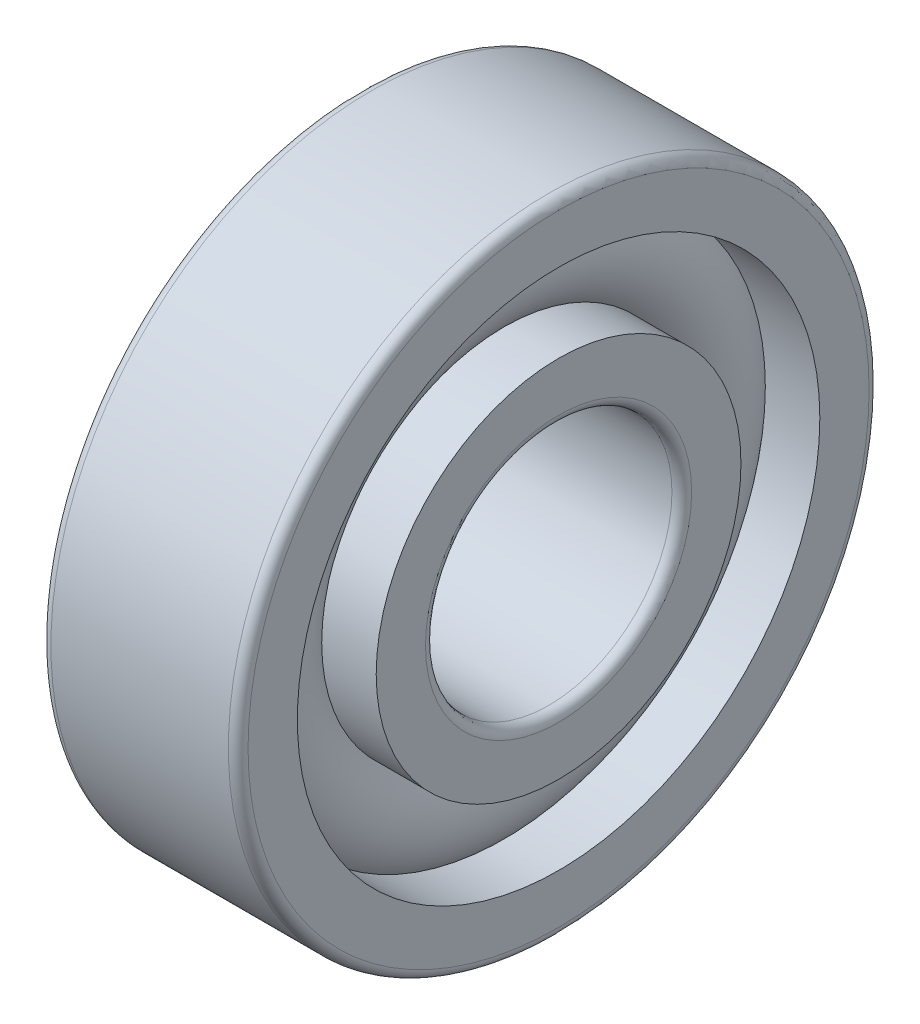
ISO-10303-21;
HEADER;
FILE_DESCRIPTION(('STEP AP214'),'2;1');
FILE_NAME('part.step','',(''),(''),'','','');
FILE_SCHEMA(('AUTOMOTIVE_DESIGN { 1 0 10303 214 1 1 1 1 }'));
ENDSEC;
DATA;
#1=APPLICATION_CONTEXT('core data for automotive mechanical design processes');
#2=APPLICATION_PROTOCOL_DEFINITION('international standard','automotive_design',2000,#1);
#3=PRODUCT_CONTEXT('',#1,'mechanical');
#4=PRODUCT('Part','Part','',(#3));
#5=PRODUCT_RELATED_PRODUCT_CATEGORY('part','',(#4));
#6=PRODUCT_DEFINITION_FORMATION('','',#4);
#7=PRODUCT_DEFINITION_CONTEXT('part definition',#1,'design');
#8=PRODUCT_DEFINITION('design','',#6,#7);
#9=PRODUCT_DEFINITION_SHAPE('','',#8);
#10=(LENGTH_UNIT() NAMED_UNIT(*) SI_UNIT(.MILLI.,.METRE.));
#11=(NAMED_UNIT(*) PLANE_ANGLE_UNIT() SI_UNIT($,.RADIAN.));
#12=(NAMED_UNIT(*) SI_UNIT($,.STERADIAN.) SOLID_ANGLE_UNIT());
#13=UNCERTAINTY_MEASURE_WITH_UNIT(LENGTH_MEASURE(1.E-05),#10,'distance_accuracy_value','');
#14=(GEOMETRIC_REPRESENTATION_CONTEXT(3) GLOBAL_UNCERTAINTY_ASSIGNED_CONTEXT((#13)) GLOBAL_UNIT_ASSIGNED_CONTEXT((#10,
#11,#12)) REPRESENTATION_CONTEXT('',''));
#15=CARTESIAN_POINT('',(0.,0.,0.));
#16=DIRECTION('',(0.,0.,1.));
#17=DIRECTION('',(1.,0.,0.));
#18=AXIS2_PLACEMENT_3D('',#15,#16,#17);
#19=CARTESIAN_POINT('',(0.,0.,0.));
#20=DIRECTION('',(-1.,0.,0.));
#21=DIRECTION('',(0.,0.,1.));
#22=AXIS2_PLACEMENT_3D('',#19,#20,#21);
#23=TOROIDAL_SURFACE('',#22,4.5,1.2);
#24=CARTESIAN_POINT('',(0.894427190999912,0.,0.));
#25=DIRECTION('',(-1.,0.,0.));
#26=DIRECTION('',(0.,0.,1.));
#27=AXIS2_PLACEMENT_3D('',#24,#25,#26);
#28=CIRCLE('',#27,5.3);
#29=CARTESIAN_POINT('',(0.894427190999912,0.,5.3));
#30=VERTEX_POINT('',#29);
#31=EDGE_CURVE('E34',#30,#30,#28,.F.);
#32=ORIENTED_EDGE('',*,*,#31,.T.);
#33=EDGE_LOOP('',(#32));
#34=FACE_BOUND('',#33,.T.);
#35=CARTESIAN_POINT('',(0.894427190999916,0.,0.));
#36=DIRECTION('',(-1.,0.,0.));
#37=DIRECTION('',(0.,0.,1.));
#38=AXIS2_PLACEMENT_3D('',#35,#36,#37);
#39=CIRCLE('',#38,3.7);
#40=CARTESIAN_POINT('',(0.894427190999916,0.,3.7));
#41=VERTEX_POINT('',#40);
#42=EDGE_CURVE('E10',#41,#41,#39,.T.);
#43=ORIENTED_EDGE('',*,*,#42,.T.);
#44=EDGE_LOOP('',(#43));
#45=FACE_BOUND('',#44,.T.);
#46=ADVANCED_FACE('F30',(#34,#45),#23,.T.);
#47=CARTESIAN_POINT('',(-20.6375,0.,0.));
#48=DIRECTION('',(1.,0.,0.));
#49=DIRECTION('',(0.,0.,-1.));
#50=AXIS2_PLACEMENT_3D('',#47,#48,#49);
#51=CYLINDRICAL_SURFACE('',#50,3.7);
#52=CARTESIAN_POINT('',(2.,0.,0.));
#53=DIRECTION('',(1.,0.,0.));
#54=DIRECTION('',(0.,0.,-1.));
#55=AXIS2_PLACEMENT_3D('',#52,#53,#54);
#56=CIRCLE('',#55,3.7);
#57=CARTESIAN_POINT('',(2.,0.,-3.7));
#58=VERTEX_POINT('',#57);
#59=EDGE_CURVE('E43',#58,#58,#56,.T.);
#60=ORIENTED_EDGE('',*,*,#59,.F.);
#61=EDGE_LOOP('',(#60));
#62=FACE_BOUND('',#61,.T.);
#63=ORIENTED_EDGE('',*,*,#42,.F.);
#64=EDGE_LOOP('',(#63));
#65=FACE_BOUND('',#64,.T.);
#66=ADVANCED_FACE('F82',(#62,#65),#51,.T.);
#67=CARTESIAN_POINT('',(-20.6375,0.,0.));
#68=DIRECTION('',(1.,0.,0.));
#69=DIRECTION('',(0.,0.,-1.));
#70=AXIS2_PLACEMENT_3D('',#67,#68,#69);
#71=CYLINDRICAL_SURFACE('',#70,3.7);
#72=CARTESIAN_POINT('',(-2.,0.,0.));
#73=DIRECTION('',(1.,0.,0.));
#74=DIRECTION('',(0.,0.,-1.));
#75=AXIS2_PLACEMENT_3D('',#72,#73,#74);
#76=CIRCLE('',#75,3.7);
#77=CARTESIAN_POINT('',(-2.,0.,-3.7));
#78=VERTEX_POINT('',#77);
#79=EDGE_CURVE('E52',#78,#78,#76,.T.);
#80=ORIENTED_EDGE('',*,*,#79,.T.);
#81=EDGE_LOOP('',(#80));
#82=FACE_BOUND('',#81,.T.);
#83=CARTESIAN_POINT('',(-0.894427190999916,0.,0.));
#84=DIRECTION('',(1.,0.,0.));
#85=DIRECTION('',(0.,0.,-1.));
#86=AXIS2_PLACEMENT_3D('',#83,#84,#85);
#87=CIRCLE('',#86,3.7);
#88=CARTESIAN_POINT('',(-0.894427190999916,0.,-3.7));
#89=VERTEX_POINT('',#88);
#90=EDGE_CURVE('E38',#89,#89,#87,.T.);
#91=ORIENTED_EDGE('',*,*,#90,.F.);
#92=EDGE_LOOP('',(#91));
#93=FACE_BOUND('',#92,.T.);
#94=ADVANCED_FACE('F85',(#82,#93),#71,.T.);
#95=CARTESIAN_POINT('',(2.,2.7,0.));
#96=DIRECTION('',(1.,0.,0.));
#97=DIRECTION('',(0.,0.,-1.));
#98=AXIS2_PLACEMENT_3D('',#95,#96,#97);
#99=PLANE('',#98);
#100=ORIENTED_EDGE('',*,*,#59,.T.);
#101=EDGE_LOOP('',(#100));
#102=FACE_BOUND('',#101,.T.);
#103=CARTESIAN_POINT('',(2.,0.,0.));
#104=DIRECTION('',(1.,0.,0.));
#105=DIRECTION('',(0.,0.,-1.));
#106=AXIS2_PLACEMENT_3D('',#103,#104,#105);
#107=CIRCLE('',#106,2.7);
#108=CARTESIAN_POINT('',(2.,0.,-2.7));
#109=VERTEX_POINT('',#108);
#110=EDGE_CURVE('E74',#109,#109,#107,.T.);
#111=ORIENTED_EDGE('',*,*,#110,.F.);
#112=EDGE_LOOP('',(#111));
#113=FACE_BOUND('',#112,.T.);
#114=ADVANCED_FACE('F79',(#102,#113),#99,.T.);
#115=CARTESIAN_POINT('',(1.8,0.,0.));
#116=DIRECTION('',(1.,0.,0.));
#117=DIRECTION('',(0.,0.,-1.));
#118=AXIS2_PLACEMENT_3D('',#115,#116,#117);
#119=TOROIDAL_SURFACE('',#118,2.7,0.200000000000001);
#120=ORIENTED_EDGE('',*,*,#110,.T.);
#121=EDGE_LOOP('',(#120));
#122=FACE_BOUND('',#121,.T.);
#123=CARTESIAN_POINT('',(1.8,0.,0.));
#124=DIRECTION('',(1.,0.,0.));
#125=DIRECTION('',(0.,0.,-1.));
#126=AXIS2_PLACEMENT_3D('',#123,#124,#125);
#127=CIRCLE('',#126,2.5);
#128=CARTESIAN_POINT('',(1.8,0.,-2.5));
#129=VERTEX_POINT('',#128);
#130=EDGE_CURVE('E71',#129,#129,#127,.T.);
#131=ORIENTED_EDGE('',*,*,#130,.F.);
#132=EDGE_LOOP('',(#131));
#133=FACE_BOUND('',#132,.T.);
#134=ADVANCED_FACE('F96',(#122,#133),#119,.T.);
#135=CARTESIAN_POINT('',(-20.6375,0.,0.));
#136=DIRECTION('',(1.,0.,0.));
#137=DIRECTION('',(0.,0.,-1.));
#138=AXIS2_PLACEMENT_3D('',#135,#136,#137);
#139=CYLINDRICAL_SURFACE('',#138,2.5);
#140=ORIENTED_EDGE('',*,*,#130,.T.);
#141=EDGE_LOOP('',(#140));
#142=FACE_BOUND('',#141,.T.);
#143=CARTESIAN_POINT('',(-1.8,0.,0.));
#144=DIRECTION('',(1.,0.,0.));
#145=DIRECTION('',(0.,0.,-1.));
#146=AXIS2_PLACEMENT_3D('',#143,#144,#145);
#147=CIRCLE('',#146,2.5);
#148=CARTESIAN_POINT('',(-1.8,0.,-2.5));
#149=VERTEX_POINT('',#148);
#150=EDGE_CURVE('E68',#149,#149,#147,.T.);
#151=ORIENTED_EDGE('',*,*,#150,.F.);
#152=EDGE_LOOP('',(#151));
#153=FACE_BOUND('',#152,.T.);
#154=ADVANCED_FACE('F99',(#142,#153),#139,.F.);
#155=CARTESIAN_POINT('',(-1.8,0.,0.));
#156=DIRECTION('',(1.,0.,0.));
#157=DIRECTION('',(0.,0.,-1.));
#158=AXIS2_PLACEMENT_3D('',#155,#156,#157);
#159=TOROIDAL_SURFACE('',#158,2.7,0.200000000000001);
#160=ORIENTED_EDGE('',*,*,#150,.T.);
#161=EDGE_LOOP('',(#160));
#162=FACE_BOUND('',#161,.T.);
#163=CARTESIAN_POINT('',(-2.,0.,0.));
#164=DIRECTION('',(1.,0.,0.));
#165=DIRECTION('',(0.,0.,-1.));
#166=AXIS2_PLACEMENT_3D('',#163,#164,#165);
#167=CIRCLE('',#166,2.7);
#168=CARTESIAN_POINT('',(-2.,0.,-2.7));
#169=VERTEX_POINT('',#168);
#170=EDGE_CURVE('E65',#169,#169,#167,.T.);
#171=ORIENTED_EDGE('',*,*,#170,.F.);
#172=EDGE_LOOP('',(#171));
#173=FACE_BOUND('',#172,.T.);
#174=ADVANCED_FACE('F103',(#162,#173),#159,.T.);
#175=CARTESIAN_POINT('',(-2.,3.7,0.));
#176=DIRECTION('',(-1.,0.,0.));
#177=DIRECTION('',(0.,0.,1.));
#178=AXIS2_PLACEMENT_3D('',#175,#176,#177);
#179=PLANE('',#178);
#180=ORIENTED_EDGE('',*,*,#170,.T.);
#181=EDGE_LOOP('',(#180));
#182=FACE_BOUND('',#181,.T.);
#183=ORIENTED_EDGE('',*,*,#79,.F.);
#184=EDGE_LOOP('',(#183));
#185=FACE_BOUND('',#184,.T.);
#186=ADVANCED_FACE('F107',(#182,#185),#179,.T.);
#187=CARTESIAN_POINT('',(-0.894427190999912,0.,0.));
#188=DIRECTION('',(1.,0.,0.));
#189=DIRECTION('',(0.,0.,-1.));
#190=AXIS2_PLACEMENT_3D('',#187,#188,#189);
#191=CIRCLE('',#190,5.3);
#192=CARTESIAN_POINT('',(-0.894427190999912,0.,-5.3));
#193=VERTEX_POINT('',#192);
#194=EDGE_CURVE('E46',#193,#193,#191,.F.);
#195=ORIENTED_EDGE('',*,*,#194,.T.);
#196=EDGE_LOOP('',(#195));
#197=FACE_BOUND('',#196,.T.);
#198=ORIENTED_EDGE('',*,*,#90,.T.);
#199=EDGE_LOOP('',(#198));
#200=FACE_BOUND('',#199,.T.);
#201=ADVANCED_FACE('F32',(#197,#200),#23,.T.);
#202=CARTESIAN_POINT('',(-20.6375,0.,0.));
#203=DIRECTION('',(1.,0.,0.));
#204=DIRECTION('',(0.,0.,-1.));
#205=AXIS2_PLACEMENT_3D('',#202,#203,#204);
#206=CYLINDRICAL_SURFACE('',#205,5.3);
#207=CARTESIAN_POINT('',(2.,0.,0.));
#208=DIRECTION('',(1.,0.,0.));
#209=DIRECTION('',(0.,0.,-1.));
#210=AXIS2_PLACEMENT_3D('',#207,#208,#209);
#211=CIRCLE('',#210,5.30000000000001);
#212=CARTESIAN_POINT('',(2.,0.,-5.30000000000001));
#213=VERTEX_POINT('',#212);
#214=EDGE_CURVE('E48',#213,#213,#211,.T.);
#215=ORIENTED_EDGE('',*,*,#214,.T.);
#216=EDGE_LOOP('',(#215));
#217=FACE_BOUND('',#216,.T.);
#218=ORIENTED_EDGE('',*,*,#31,.F.);
#219=EDGE_LOOP('',(#218));
#220=FACE_BOUND('',#219,.T.);
#221=ADVANCED_FACE('F112',(#217,#220),#206,.F.);
#222=CARTESIAN_POINT('',(-20.6375,0.,0.));
#223=DIRECTION('',(1.,0.,0.));
#224=DIRECTION('',(0.,0.,-1.));
#225=AXIS2_PLACEMENT_3D('',#222,#223,#224);
#226=CYLINDRICAL_SURFACE('',#225,5.3);
#227=CARTESIAN_POINT('',(-2.,0.,0.));
#228=DIRECTION('',(1.,0.,0.));
#229=DIRECTION('',(0.,0.,-1.));
#230=AXIS2_PLACEMENT_3D('',#227,#228,#229);
#231=CIRCLE('',#230,5.30000000000001);
#232=CARTESIAN_POINT('',(-2.,0.,-5.30000000000001));
#233=VERTEX_POINT('',#232);
#234=EDGE_CURVE('E143',#233,#233,#231,.T.);
#235=ORIENTED_EDGE('',*,*,#234,.F.);
#236=EDGE_LOOP('',(#235));
#237=FACE_BOUND('',#236,.T.);
#238=ORIENTED_EDGE('',*,*,#194,.F.);
#239=EDGE_LOOP('',(#238));
#240=FACE_BOUND('',#239,.T.);
#241=ADVANCED_FACE('F115',(#237,#240),#226,.F.);
#242=CARTESIAN_POINT('',(2.,6.30000000000001,0.));
#243=DIRECTION('',(1.,0.,0.));
#244=DIRECTION('',(0.,0.,-1.));
#245=AXIS2_PLACEMENT_3D('',#242,#243,#244);
#246=PLANE('',#245);
#247=CARTESIAN_POINT('',(2.,0.,0.));
#248=DIRECTION('',(1.,0.,0.));
#249=DIRECTION('',(0.,0.,-1.));
#250=AXIS2_PLACEMENT_3D('',#247,#248,#249);
#251=CIRCLE('',#250,6.30000000000001);
#252=CARTESIAN_POINT('',(2.,0.,-6.30000000000001));
#253=VERTEX_POINT('',#252);
#254=EDGE_CURVE('E54',#253,#253,#251,.T.);
#255=ORIENTED_EDGE('',*,*,#254,.T.);
#256=EDGE_LOOP('',(#255));
#257=FACE_BOUND('',#256,.T.);
#258=ORIENTED_EDGE('',*,*,#214,.F.);
#259=EDGE_LOOP('',(#258));
#260=FACE_BOUND('',#259,.T.);
#261=ADVANCED_FACE('F116',(#257,#260),#246,.T.);
#262=CARTESIAN_POINT('',(1.8,0.,0.));
#263=DIRECTION('',(1.,0.,0.));
#264=DIRECTION('',(0.,0.,-1.));
#265=AXIS2_PLACEMENT_3D('',#262,#263,#264);
#266=TOROIDAL_SURFACE('',#265,6.30000000000001,0.2);
#267=CARTESIAN_POINT('',(1.8,0.,0.));
#268=DIRECTION('',(1.,0.,0.));
#269=DIRECTION('',(0.,0.,-1.));
#270=AXIS2_PLACEMENT_3D('',#267,#268,#269);
#271=CIRCLE('',#270,6.50000000000001);
#272=CARTESIAN_POINT('',(1.8,0.,-6.50000000000001));
#273=VERTEX_POINT('',#272);
#274=EDGE_CURVE('E59',#273,#273,#271,.T.);
#275=ORIENTED_EDGE('',*,*,#274,.T.);
#276=EDGE_LOOP('',(#275));
#277=FACE_BOUND('',#276,.T.);
#278=ORIENTED_EDGE('',*,*,#254,.F.);
#279=EDGE_LOOP('',(#278));
#280=FACE_BOUND('',#279,.T.);
#281=ADVANCED_FACE('F119',(#277,#280),#266,.T.);
#282=CARTESIAN_POINT('',(-20.6375,0.,0.));
#283=DIRECTION('',(1.,0.,0.));
#284=DIRECTION('',(0.,0.,-1.));
#285=AXIS2_PLACEMENT_3D('',#282,#283,#284);
#286=CYLINDRICAL_SURFACE('',#285,6.50000000000001);
#287=CARTESIAN_POINT('',(-1.8,0.,0.));
#288=DIRECTION('',(1.,0.,0.));
#289=DIRECTION('',(0.,0.,-1.));
#290=AXIS2_PLACEMENT_3D('',#287,#288,#289);
#291=CIRCLE('',#290,6.50000000000001);
#292=CARTESIAN_POINT('',(-1.8,0.,-6.50000000000001));
#293=VERTEX_POINT('',#292);
#294=EDGE_CURVE('E147',#293,#293,#291,.T.);
#295=ORIENTED_EDGE('',*,*,#294,.T.);
#296=EDGE_LOOP('',(#295));
#297=FACE_BOUND('',#296,.T.);
#298=ORIENTED_EDGE('',*,*,#274,.F.);
#299=EDGE_LOOP('',(#298));
#300=FACE_BOUND('',#299,.T.);
#301=ADVANCED_FACE('F123',(#297,#300),#286,.T.);
#302=CARTESIAN_POINT('',(-1.8,0.,0.));
#303=DIRECTION('',(1.,0.,0.));
#304=DIRECTION('',(0.,0.,-1.));
#305=AXIS2_PLACEMENT_3D('',#302,#303,#304);
#306=TOROIDAL_SURFACE('',#305,6.30000000000001,0.2);
#307=CARTESIAN_POINT('',(-2.,0.,0.));
#308=DIRECTION('',(1.,0.,0.));
#309=DIRECTION('',(0.,0.,-1.));
#310=AXIS2_PLACEMENT_3D('',#307,#308,#309);
#311=CIRCLE('',#310,6.30000000000001);
#312=CARTESIAN_POINT('',(-2.,0.,-6.30000000000001));
#313=VERTEX_POINT('',#312);
#314=EDGE_CURVE('E144',#313,#313,#311,.T.);
#315=ORIENTED_EDGE('',*,*,#314,.T.);
#316=EDGE_LOOP('',(#315));
#317=FACE_BOUND('',#316,.T.);
#318=ORIENTED_EDGE('',*,*,#294,.F.);
#319=EDGE_LOOP('',(#318));
#320=FACE_BOUND('',#319,.T.);
#321=ADVANCED_FACE('F127',(#317,#320),#306,.T.);
#322=CARTESIAN_POINT('',(-2.,5.30000000000001,0.));
#323=DIRECTION('',(-1.,0.,0.));
#324=DIRECTION('',(0.,0.,1.));
#325=AXIS2_PLACEMENT_3D('',#322,#323,#324);
#326=PLANE('',#325);
#327=ORIENTED_EDGE('',*,*,#234,.T.);
#328=EDGE_LOOP('',(#327));
#329=FACE_BOUND('',#328,.T.);
#330=ORIENTED_EDGE('',*,*,#314,.F.);
#331=EDGE_LOOP('',(#330));
#332=FACE_BOUND('',#331,.T.);
#333=ADVANCED_FACE('F131',(#329,#332),#326,.T.);
#334=CLOSED_SHELL('',(#46,#66,#94,#114,#134,#154,#174,#186,#201,#221,#241,#261,#281,#301,#321,#333));
#335=MANIFOLD_SOLID_BREP('B2',#334);
#336=ADVANCED_BREP_SHAPE_REPRESENTATION('',(#18,#335),#14);
#337=SHAPE_DEFINITION_REPRESENTATION(#9,#336);
ENDSEC;
END-ISO-10303-21;
